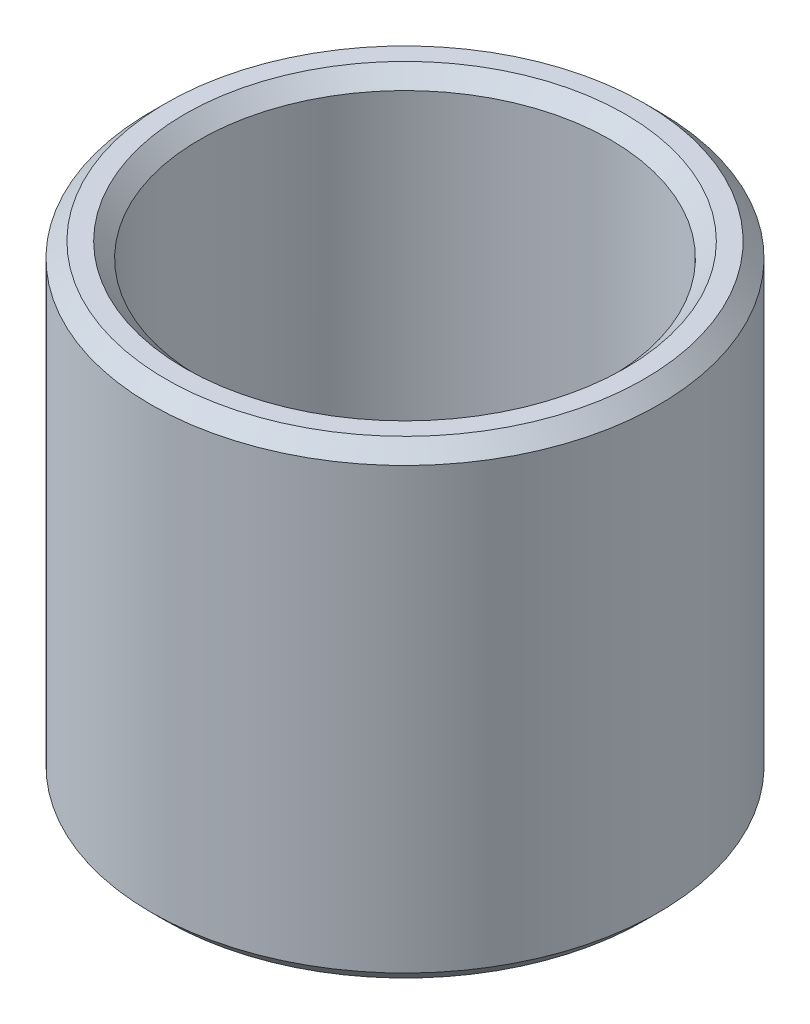
ISO-10303-21;
HEADER;
FILE_DESCRIPTION(('STEP AP214'),'2;1');
FILE_NAME('part.step','',(''),(''),'','','');
FILE_SCHEMA(('AUTOMOTIVE_DESIGN { 1 0 10303 214 1 1 1 1 }'));
ENDSEC;
DATA;
#1=APPLICATION_CONTEXT('core data for automotive mechanical design processes');
#2=APPLICATION_PROTOCOL_DEFINITION('international standard','automotive_design',2000,#1);
#3=PRODUCT_CONTEXT('',#1,'mechanical');
#4=PRODUCT('Part','Part','',(#3));
#5=PRODUCT_RELATED_PRODUCT_CATEGORY('part','',(#4));
#6=PRODUCT_DEFINITION_FORMATION('','',#4);
#7=PRODUCT_DEFINITION_CONTEXT('part definition',#1,'design');
#8=PRODUCT_DEFINITION('design','',#6,#7);
#9=PRODUCT_DEFINITION_SHAPE('','',#8);
#10=(LENGTH_UNIT() NAMED_UNIT(*) SI_UNIT(.MILLI.,.METRE.));
#11=(NAMED_UNIT(*) PLANE_ANGLE_UNIT() SI_UNIT($,.RADIAN.));
#12=(NAMED_UNIT(*) SI_UNIT($,.STERADIAN.) SOLID_ANGLE_UNIT());
#13=UNCERTAINTY_MEASURE_WITH_UNIT(LENGTH_MEASURE(1.E-05),#10,'distance_accuracy_value','');
#14=(GEOMETRIC_REPRESENTATION_CONTEXT(3) GLOBAL_UNCERTAINTY_ASSIGNED_CONTEXT((#13)) GLOBAL_UNIT_ASSIGNED_CONTEXT((#10,
#11,#12)) REPRESENTATION_CONTEXT('',''));
#15=CARTESIAN_POINT('',(0.,0.,0.));
#16=DIRECTION('',(0.,0.,1.));
#17=DIRECTION('',(1.,0.,0.));
#18=AXIS2_PLACEMENT_3D('',#15,#16,#17);
#19=CARTESIAN_POINT('',(0.,110.87264076136,0.));
#20=DIRECTION('',(0.,-1.,0.));
#21=DIRECTION('',(0.,0.,-1.));
#22=AXIS2_PLACEMENT_3D('',#19,#20,#21);
#23=CYLINDRICAL_SURFACE('',#22,60.);
#24=CARTESIAN_POINT('',(0.,3.49739664462005,0.));
#25=DIRECTION('',(0.,1.,0.));
#26=DIRECTION('',(0.,0.,1.));
#27=AXIS2_PLACEMENT_3D('',#24,#25,#26);
#28=CIRCLE('',#27,60.);
#29=CARTESIAN_POINT('',(0.,3.49739664462005,60.));
#30=VERTEX_POINT('',#29);
#31=EDGE_CURVE('E10',#30,#30,#28,.T.);
#32=ORIENTED_EDGE('',*,*,#31,.T.);
#33=EDGE_LOOP('',(#32));
#34=FACE_BOUND('',#33,.T.);
#35=CARTESIAN_POINT('',(0.,107.37524411674,0.));
#36=DIRECTION('',(0.,1.,0.));
#37=DIRECTION('',(0.,0.,1.));
#38=AXIS2_PLACEMENT_3D('',#35,#36,#37);
#39=CIRCLE('',#38,60.);
#40=CARTESIAN_POINT('',(0.,107.37524411674,-60.));
#41=VERTEX_POINT('',#40);
#42=EDGE_CURVE('E50',#41,#41,#39,.F.);
#43=ORIENTED_EDGE('',*,*,#42,.T.);
#44=EDGE_LOOP('',(#43));
#45=FACE_BOUND('',#44,.T.);
#46=ADVANCED_FACE('F39',(#34,#45),#23,.T.);
#47=CARTESIAN_POINT('',(0.,110.87264076136,0.));
#48=DIRECTION('',(0.,1.,0.));
#49=DIRECTION('',(0.,0.,1.));
#50=AXIS2_PLACEMENT_3D('',#47,#48,#49);
#51=PLANE('',#50);
#52=CARTESIAN_POINT('',(0.,110.87264076136,0.));
#53=DIRECTION('',(0.,1.,0.));
#54=DIRECTION('',(0.,0.,1.));
#55=AXIS2_PLACEMENT_3D('',#52,#53,#54);
#56=CIRCLE('',#55,52.0319912968084);
#57=CARTESIAN_POINT('',(0.,110.87264076136,52.0319912968084));
#58=VERTEX_POINT('',#57);
#59=EDGE_CURVE('E58',#58,#58,#56,.F.);
#60=ORIENTED_EDGE('',*,*,#59,.T.);
#61=EDGE_LOOP('',(#60));
#62=FACE_BOUND('',#61,.T.);
#63=CARTESIAN_POINT('',(0.,110.87264076136,0.));
#64=DIRECTION('',(0.,1.,0.));
#65=DIRECTION('',(0.,0.,1.));
#66=AXIS2_PLACEMENT_3D('',#63,#64,#65);
#67=CIRCLE('',#66,56.5026033553799);
#68=CARTESIAN_POINT('',(0.,110.87264076136,-56.5026033553799));
#69=VERTEX_POINT('',#68);
#70=EDGE_CURVE('E61',#69,#69,#67,.T.);
#71=ORIENTED_EDGE('',*,*,#70,.T.);
#72=EDGE_LOOP('',(#71));
#73=FACE_BOUND('',#72,.T.);
#74=ADVANCED_FACE('F88',(#62,#73),#51,.T.);
#75=CARTESIAN_POINT('',(0.,0.,0.));
#76=DIRECTION('',(0.,1.,0.));
#77=DIRECTION('',(0.,0.,1.));
#78=AXIS2_PLACEMENT_3D('',#75,#76,#77);
#79=PLANE('',#78);
#80=CARTESIAN_POINT('',(0.,0.,0.));
#81=DIRECTION('',(0.,1.,0.));
#82=DIRECTION('',(0.,0.,1.));
#83=AXIS2_PLACEMENT_3D('',#80,#81,#82);
#84=CIRCLE('',#83,52.0319912968084);
#85=CARTESIAN_POINT('',(0.,0.,-52.0319912968084));
#86=VERTEX_POINT('',#85);
#87=EDGE_CURVE('E51',#86,#86,#84,.T.);
#88=ORIENTED_EDGE('',*,*,#87,.T.);
#89=EDGE_LOOP('',(#88));
#90=FACE_BOUND('',#89,.T.);
#91=CARTESIAN_POINT('',(0.,0.,0.));
#92=DIRECTION('',(0.,1.,0.));
#93=DIRECTION('',(0.,0.,1.));
#94=AXIS2_PLACEMENT_3D('',#91,#92,#93);
#95=CIRCLE('',#94,56.5026033553799);
#96=CARTESIAN_POINT('',(0.,0.,56.5026033553799));
#97=VERTEX_POINT('',#96);
#98=EDGE_CURVE('E54',#97,#97,#95,.F.);
#99=ORIENTED_EDGE('',*,*,#98,.T.);
#100=EDGE_LOOP('',(#99));
#101=FACE_BOUND('',#100,.T.);
#102=ADVANCED_FACE('F83',(#90,#101),#79,.F.);
#103=CARTESIAN_POINT('',(0.,110.87264076136,0.));
#104=DIRECTION('',(0.,-1.,0.));
#105=DIRECTION('',(0.,0.,-1.));
#106=AXIS2_PLACEMENT_3D('',#103,#104,#105);
#107=CYLINDRICAL_SURFACE('',#106,48.5345946521883);
#108=CARTESIAN_POINT('',(0.,107.37524411674,0.));
#109=DIRECTION('',(0.,1.,0.));
#110=DIRECTION('',(0.,0.,1.));
#111=AXIS2_PLACEMENT_3D('',#108,#109,#110);
#112=CIRCLE('',#111,48.5345946521883);
#113=CARTESIAN_POINT('',(0.,107.37524411674,48.5345946521883));
#114=VERTEX_POINT('',#113);
#115=EDGE_CURVE('E67',#114,#114,#112,.T.);
#116=ORIENTED_EDGE('',*,*,#115,.T.);
#117=EDGE_LOOP('',(#116));
#118=FACE_BOUND('',#117,.T.);
#119=CARTESIAN_POINT('',(0.,3.49739664462009,0.));
#120=DIRECTION('',(0.,1.,0.));
#121=DIRECTION('',(0.,0.,1.));
#122=AXIS2_PLACEMENT_3D('',#119,#120,#121);
#123=CIRCLE('',#122,48.5345946521883);
#124=CARTESIAN_POINT('',(0.,3.49739664462009,-48.5345946521883));
#125=VERTEX_POINT('',#124);
#126=EDGE_CURVE('E69',#125,#125,#123,.F.);
#127=ORIENTED_EDGE('',*,*,#126,.T.);
#128=EDGE_LOOP('',(#127));
#129=FACE_BOUND('',#128,.T.);
#130=ADVANCED_FACE('F71',(#118,#129),#107,.F.);
#131=CARTESIAN_POINT('',(0.,107.37524411674,0.));
#132=DIRECTION('',(0.,1.,0.));
#133=DIRECTION('',(0.,0.,1.));
#134=AXIS2_PLACEMENT_3D('',#131,#132,#133);
#135=CONICAL_SURFACE('',#134,48.5345946521883,0.785398163397452);
#136=ORIENTED_EDGE('',*,*,#59,.F.);
#137=EDGE_LOOP('',(#136));
#138=FACE_BOUND('',#137,.T.);
#139=ORIENTED_EDGE('',*,*,#115,.F.);
#140=EDGE_LOOP('',(#139));
#141=FACE_BOUND('',#140,.T.);
#142=ADVANCED_FACE('F77',(#138,#141),#135,.F.);
#143=CARTESIAN_POINT('',(0.,0.,0.));
#144=DIRECTION('',(0.,-1.,0.));
#145=DIRECTION('',(0.,0.,-1.));
#146=AXIS2_PLACEMENT_3D('',#143,#144,#145);
#147=CONICAL_SURFACE('',#146,52.0319912968084,0.785398163397447);
#148=CARTESIAN_POINT('',(0.,3.49739664462009,-48.5345946521883));
#149=CARTESIAN_POINT('',(0.,3.46096542957197,-48.5710258672365));
#150=CARTESIAN_POINT('',(0.,3.42453421452384,-48.6074570822846));
#151=CARTESIAN_POINT('',(0.,3.35167178442759,-48.6803195123809));
#152=CARTESIAN_POINT('',(0.,3.31524056937946,-48.716750727429));
#153=CARTESIAN_POINT('',(0.,3.24237813928321,-48.7896131575252));
#154=CARTESIAN_POINT('',(0.,3.20594692423509,-48.8260443725734));
#155=CARTESIAN_POINT('',(0.,3.13308449413883,-48.8989068026696));
#156=CARTESIAN_POINT('',(0.,3.09665327909071,-48.9353380177177));
#157=CARTESIAN_POINT('',(0.,3.02379084899445,-49.008200447814));
#158=CARTESIAN_POINT('',(0.,2.98735963394633,-49.0446316628621));
#159=CARTESIAN_POINT('',(0.,2.91449720385008,-49.1174940929584));
#160=CARTESIAN_POINT('',(0.,2.87806598880195,-49.1539253080065));
#161=CARTESIAN_POINT('',(0.,2.8052035587057,-49.2267877381027));
#162=CARTESIAN_POINT('',(0.,2.76877234365757,-49.2632189531509));
#163=CARTESIAN_POINT('',(0.,2.69590991356132,-49.3360813832471));
#164=CARTESIAN_POINT('',(0.,2.6594786985132,-49.3725125982952));
#165=CARTESIAN_POINT('',(0.,2.58661626841694,-49.4453750283915));
#166=CARTESIAN_POINT('',(0.,2.55018505336882,-49.4818062434396));
#167=CARTESIAN_POINT('',(0.,2.47732262327257,-49.5546686735359));
#168=CARTESIAN_POINT('',(0.,2.44089140822444,-49.591099888584));
#169=CARTESIAN_POINT('',(0.,2.36802897812819,-49.6639623186802));
#170=CARTESIAN_POINT('',(0.,2.33159776308006,-49.7003935337284));
#171=CARTESIAN_POINT('',(0.,2.25873533298381,-49.7732559638246));
#172=CARTESIAN_POINT('',(0.,2.22230411793568,-49.8096871788727));
#173=CARTESIAN_POINT('',(0.,2.14944168783943,-49.882549608969));
#174=CARTESIAN_POINT('',(0.,2.11301047279131,-49.9189808240171));
#175=CARTESIAN_POINT('',(0.,2.04014804269505,-49.9918432541134));
#176=CARTESIAN_POINT('',(0.,2.00371682764693,-50.0282744691615));
#177=CARTESIAN_POINT('',(0.,1.93085439755068,-50.1011368992578));
#178=CARTESIAN_POINT('',(0.,1.89442318250255,-50.1375681143059));
#179=CARTESIAN_POINT('',(0.,1.8215607524063,-50.2104305444021));
#180=CARTESIAN_POINT('',(0.,1.78512953735817,-50.2468617594503));
#181=CARTESIAN_POINT('',(0.,1.71226710726192,-50.3197241895465));
#182=CARTESIAN_POINT('',(0.,1.67583589221379,-50.3561554045946));
#183=CARTESIAN_POINT('',(0.,1.60297346211754,-50.4290178346909));
#184=CARTESIAN_POINT('',(0.,1.56654224706942,-50.465449049739));
#185=CARTESIAN_POINT('',(0.,1.49367981697316,-50.5383114798353));
#186=CARTESIAN_POINT('',(0.,1.45724860192504,-50.5747426948834));
#187=CARTESIAN_POINT('',(0.,1.38438617182879,-50.6476051249796));
#188=CARTESIAN_POINT('',(0.,1.34795495678066,-50.6840363400278));
#189=CARTESIAN_POINT('',(0.,1.27509252668441,-50.756898770124));
#190=CARTESIAN_POINT('',(0.,1.23866131163628,-50.7933299851722));
#191=CARTESIAN_POINT('',(0.,1.16579888154003,-50.8661924152684));
#192=CARTESIAN_POINT('',(0.,1.12936766649191,-50.9026236303165));
#193=CARTESIAN_POINT('',(0.,1.05650523639565,-50.9754860604128));
#194=CARTESIAN_POINT('',(0.,1.02007402134753,-51.0119172754609));
#195=CARTESIAN_POINT('',(0.,0.947211591251274,-51.0847797055572));
#196=CARTESIAN_POINT('',(0.,0.910780376203149,-51.1212109206053));
#197=CARTESIAN_POINT('',(0.,0.837917946106897,-51.1940733507015));
#198=CARTESIAN_POINT('',(0.,0.801486731058771,-51.2305045657497));
#199=CARTESIAN_POINT('',(0.,0.728624300962519,-51.3033669958459));
#200=CARTESIAN_POINT('',(0.,0.692193085914393,-51.339798210894));
#201=CARTESIAN_POINT('',(0.,0.619330655818141,-51.4126606409903));
#202=CARTESIAN_POINT('',(0.,0.582899440770015,-51.4490918560384));
#203=CARTESIAN_POINT('',(0.,0.510037010673764,-51.5219542861347));
#204=CARTESIAN_POINT('',(0.,0.473605795625638,-51.5583855011828));
#205=CARTESIAN_POINT('',(0.,0.400743365529386,-51.631247931279));
#206=CARTESIAN_POINT('',(0.,0.364312150481259,-51.6676791463272));
#207=CARTESIAN_POINT('',(0.,0.291449720385007,-51.7405415764234));
#208=CARTESIAN_POINT('',(0.,0.255018505336882,-51.7769727914715));
#209=CARTESIAN_POINT('',(0.,0.18215607524063,-51.8498352215678));
#210=CARTESIAN_POINT('',(0.,0.145724860192504,-51.8862664366159));
#211=CARTESIAN_POINT('',(0.,0.0728624300962518,-51.9591288667122));
#212=CARTESIAN_POINT('',(0.,0.0364312150481258,-51.9955600817603));
#213=CARTESIAN_POINT('',(0.,0.,-52.0319912968084));
#214=B_SPLINE_CURVE_WITH_KNOTS('',3,(#148,#149,#150,#151,#152,#153,#154,#155,#156,#157,#158,
#159,#160,#161,#162,#163,#164,#165,#166,#167,#168,#169,#170,#171,#172,#173,#174,#175,#176,#177,
#178,#179,#180,#181,#182,#183,#184,#185,#186,#187,#188,#189,#190,#191,#192,#193,#194,#195,#196,
#197,#198,#199,#200,#201,#202,#203,#204,#205,#206,#207,#208,#209,#210,#211,#212,#213),
.UNSPECIFIED.,.F.,.F.,(4,2,2,2,2,2,2,2,2,2,2,2,2,2,2,2,2,2,2,2,2,2,2,2,2,2,2,2,2,2,2,2,4),(0.,
0.154564555244372,0.309129110488744,0.463693665733117,0.618258220977484,0.772822776221856,
0.927387331466229,1.0819518867106,1.23651644195497,1.39108099719934,1.54564555244371,
1.70021010768808,1.85477466293246,2.00933921817683,2.1639037734212,2.31846832866557,
2.47303288390995,2.62759743915431,2.78216199439869,2.93672654964306,3.09129110488743,
3.2458556601318,3.40042021537617,3.55498477062054,3.70954932586491,3.86411388110929,
4.01867843635366,4.17324299159803,4.3278075468424,4.48237210208677,4.63693665733114,
4.79150121257552,4.94606576781989),.UNSPECIFIED.);
#215=EDGE_CURVE('BSEAM73',#125,#86,#214,.T.);
#216=ORIENTED_EDGE('',*,*,#126,.F.);
#217=ORIENTED_EDGE('',*,*,#87,.F.);
#218=ORIENTED_EDGE('',*,*,#215,.T.);
#219=ORIENTED_EDGE('',*,*,#215,.F.);
#220=EDGE_LOOP('',(#216,#218,#217,#219));
#221=FACE_BOUND('',#220,.T.);
#222=ADVANCED_FACE('F73',(#221),#147,.F.);
#223=CARTESIAN_POINT('',(0.,3.49739664462005,0.));
#224=DIRECTION('',(0.,1.,0.));
#225=DIRECTION('',(0.,0.,1.));
#226=AXIS2_PLACEMENT_3D('',#223,#224,#225);
#227=CONICAL_SURFACE('',#226,60.,0.78539816339745);
#228=ORIENTED_EDGE('',*,*,#98,.F.);
#229=EDGE_LOOP('',(#228));
#230=FACE_BOUND('',#229,.T.);
#231=ORIENTED_EDGE('',*,*,#31,.F.);
#232=EDGE_LOOP('',(#231));
#233=FACE_BOUND('',#232,.T.);
#234=ADVANCED_FACE('F76',(#230,#233),#227,.T.);
#235=CARTESIAN_POINT('',(0.,110.87264076136,0.));
#236=DIRECTION('',(0.,-1.,0.));
#237=DIRECTION('',(0.,0.,-1.));
#238=AXIS2_PLACEMENT_3D('',#235,#236,#237);
#239=CONICAL_SURFACE('',#238,56.5026033553799,0.785398163397448);
#240=CARTESIAN_POINT('',(0.,107.37524411674,-60.));
#241=CARTESIAN_POINT('',(0.,107.411675331788,-59.9635687849519));
#242=CARTESIAN_POINT('',(0.,107.448106546836,-59.9271375699038));
#243=CARTESIAN_POINT('',(0.,107.520968976932,-59.8542751398075));
#244=CARTESIAN_POINT('',(0.,107.55740019198,-59.8178439247594));
#245=CARTESIAN_POINT('',(0.,107.630262622077,-59.7449814946631));
#246=CARTESIAN_POINT('',(0.,107.666693837125,-59.708550279615));
#247=CARTESIAN_POINT('',(0.,107.739556267221,-59.6356878495187));
#248=CARTESIAN_POINT('',(0.,107.775987482269,-59.5992566344706));
#249=CARTESIAN_POINT('',(0.,107.848849912365,-59.5263942043744));
#250=CARTESIAN_POINT('',(0.,107.885281127413,-59.4899629893262));
#251=CARTESIAN_POINT('',(0.,107.95814355751,-59.41710055923));
#252=CARTESIAN_POINT('',(0.,107.994574772558,-59.3806693441819));
#253=CARTESIAN_POINT('',(0.,108.067437202654,-59.3078069140856));
#254=CARTESIAN_POINT('',(0.,108.103868417702,-59.2713756990375));
#255=CARTESIAN_POINT('',(0.,108.176730847798,-59.1985132689412));
#256=CARTESIAN_POINT('',(0.,108.213162062847,-59.1620820538931));
#257=CARTESIAN_POINT('',(0.,108.286024492943,-59.0892196237969));
#258=CARTESIAN_POINT('',(0.,108.322455707991,-59.0527884087487));
#259=CARTESIAN_POINT('',(0.,108.395318138087,-58.9799259786525));
#260=CARTESIAN_POINT('',(0.,108.431749353135,-58.9434947636043));
#261=CARTESIAN_POINT('',(0.,108.504611783232,-58.8706323335081));
#262=CARTESIAN_POINT('',(0.,108.54104299828,-58.83420111846));
#263=CARTESIAN_POINT('',(0.,108.613905428376,-58.7613386883637));
#264=CARTESIAN_POINT('',(0.,108.650336643424,-58.7249074733156));
#265=CARTESIAN_POINT('',(0.,108.72319907352,-58.6520450432193));
#266=CARTESIAN_POINT('',(0.,108.759630288568,-58.6156138281712));
#267=CARTESIAN_POINT('',(0.,108.832492718665,-58.542751398075));
#268=CARTESIAN_POINT('',(0.,108.868923933713,-58.5063201830268));
#269=CARTESIAN_POINT('',(0.,108.941786363809,-58.4334577529306));
#270=CARTESIAN_POINT('',(0.,108.978217578857,-58.3970265378825));
#271=CARTESIAN_POINT('',(0.,109.051080008953,-58.3241641077862));
#272=CARTESIAN_POINT('',(0.,109.087511224002,-58.2877328927381));
#273=CARTESIAN_POINT('',(0.,109.160373654098,-58.2148704626418));
#274=CARTESIAN_POINT('',(0.,109.196804869146,-58.1784392475937));
#275=CARTESIAN_POINT('',(0.,109.269667299242,-58.1055768174975));
#276=CARTESIAN_POINT('',(0.,109.30609851429,-58.0691456024493));
#277=CARTESIAN_POINT('',(0.,109.378960944387,-57.9962831723531));
#278=CARTESIAN_POINT('',(0.,109.415392159435,-57.9598519573049));
#279=CARTESIAN_POINT('',(0.,109.488254589531,-57.8869895272087));
#280=CARTESIAN_POINT('',(0.,109.524685804579,-57.8505583121606));
#281=CARTESIAN_POINT('',(0.,109.597548234675,-57.7776958820643));
#282=CARTESIAN_POINT('',(0.,109.633979449723,-57.7412646670162));
#283=CARTESIAN_POINT('',(0.,109.70684187982,-57.6684022369199));
#284=CARTESIAN_POINT('',(0.,109.743273094868,-57.6319710218718));
#285=CARTESIAN_POINT('',(0.,109.816135524964,-57.5591085917756));
#286=CARTESIAN_POINT('',(0.,109.852566740012,-57.5226773767274));
#287=CARTESIAN_POINT('',(0.,109.925429170108,-57.4498149466312));
#288=CARTESIAN_POINT('',(0.,109.961860385157,-57.4133837315831));
#289=CARTESIAN_POINT('',(0.,110.034722815253,-57.3405213014868));
#290=CARTESIAN_POINT('',(0.,110.071154030301,-57.3040900864387));
#291=CARTESIAN_POINT('',(0.,110.144016460397,-57.2312276563424));
#292=CARTESIAN_POINT('',(0.,110.180447675445,-57.1947964412943));
#293=CARTESIAN_POINT('',(0.,110.253310105542,-57.1219340111981));
#294=CARTESIAN_POINT('',(0.,110.28974132059,-57.0855027961499));
#295=CARTESIAN_POINT('',(0.,110.362603750686,-57.0126403660537));
#296=CARTESIAN_POINT('',(0.,110.399034965734,-56.9762091510055));
#297=CARTESIAN_POINT('',(0.,110.47189739583,-56.9033467209093));
#298=CARTESIAN_POINT('',(0.,110.508328610878,-56.8669155058612));
#299=CARTESIAN_POINT('',(0.,110.581191040975,-56.7940530757649));
#300=CARTESIAN_POINT('',(0.,110.617622256023,-56.7576218607168));
#301=CARTESIAN_POINT('',(0.,110.690484686119,-56.6847594306205));
#302=CARTESIAN_POINT('',(0.,110.726915901167,-56.6483282155724));
#303=CARTESIAN_POINT('',(0.,110.799778331263,-56.5754657854762));
#304=CARTESIAN_POINT('',(0.,110.836209546312,-56.539034570428));
#305=CARTESIAN_POINT('',(0.,110.87264076136,-56.5026033553799));
#306=B_SPLINE_CURVE_WITH_KNOTS('',3,(#240,#241,#242,#243,#244,#245,#246,#247,#248,#249,#250,
#251,#252,#253,#254,#255,#256,#257,#258,#259,#260,#261,#262,#263,#264,#265,#266,#267,#268,#269,
#270,#271,#272,#273,#274,#275,#276,#277,#278,#279,#280,#281,#282,#283,#284,#285,#286,#287,#288,
#289,#290,#291,#292,#293,#294,#295,#296,#297,#298,#299,#300,#301,#302,#303,#304,#305),
.UNSPECIFIED.,.F.,.F.,(4,2,2,2,2,2,2,2,2,2,2,2,2,2,2,2,2,2,2,2,2,2,2,2,2,2,2,2,2,2,2,2,4),(0.,
0.154564555244373,0.309129110488746,0.463693665733114,0.618258220977486,0.772822776221859,
0.927387331466232,1.08195188671061,1.23651644195498,1.39108099719935,1.54564555244372,
1.7002101076881,1.85477466293246,2.00933921817684,2.16390377342121,2.31846832866558,
2.47303288390995,2.62759743915432,2.78216199439869,2.93672654964306,3.09129110488743,
3.24585566013181,3.40042021537618,3.55498477062055,3.70954932586492,3.8641138811093,
4.01867843635367,4.17324299159804,4.32780754684241,4.48237210208678,4.63693665733116,
4.79150121257553,4.9460657678199),.UNSPECIFIED.);
#307=EDGE_CURVE('BSEAM45',#41,#69,#306,.T.);
#308=ORIENTED_EDGE('',*,*,#42,.F.);
#309=ORIENTED_EDGE('',*,*,#70,.F.);
#310=ORIENTED_EDGE('',*,*,#307,.T.);
#311=ORIENTED_EDGE('',*,*,#307,.F.);
#312=EDGE_LOOP('',(#308,#310,#309,#311));
#313=FACE_BOUND('',#312,.T.);
#314=ADVANCED_FACE('F45',(#313),#239,.T.);
#315=CLOSED_SHELL('',(#46,#74,#102,#130,#142,#222,#234,#314));
#316=MANIFOLD_SOLID_BREP('B2',#315);
#317=ADVANCED_BREP_SHAPE_REPRESENTATION('',(#18,#316),#14);
#318=SHAPE_DEFINITION_REPRESENTATION(#9,#317);
ENDSEC;
END-ISO-10303-21;
